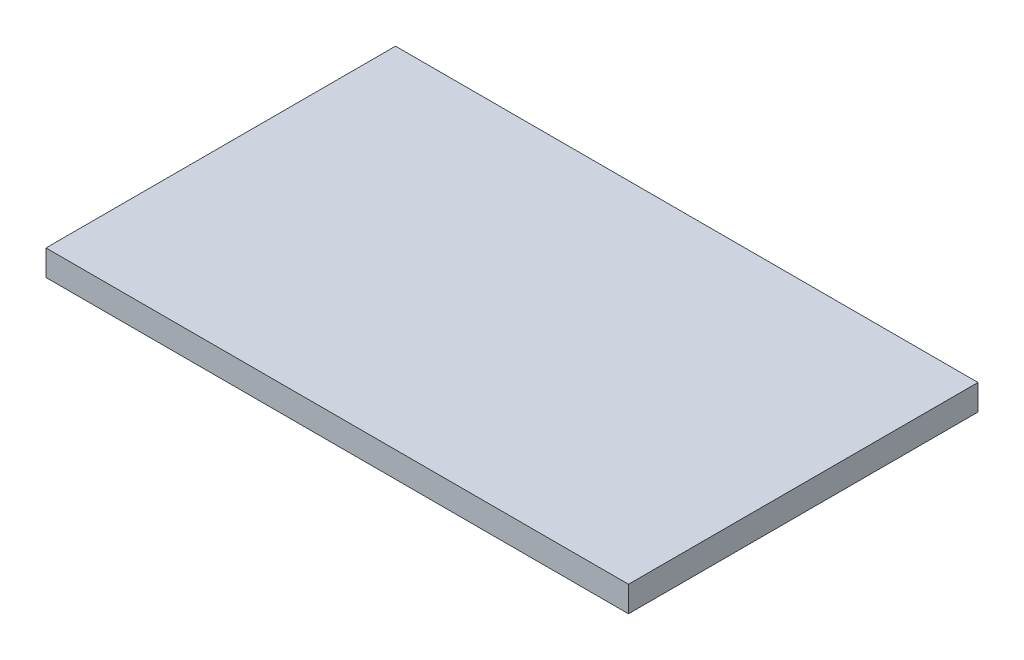
ISO-10303-21;
HEADER;
FILE_DESCRIPTION(('STEP AP214'),'2;1');
FILE_NAME('part.step','',(''),(''),'','','');
FILE_SCHEMA(('AUTOMOTIVE_DESIGN { 1 0 10303 214 1 1 1 1 }'));
ENDSEC;
DATA;
#1=APPLICATION_CONTEXT('core data for automotive mechanical design processes');
#2=APPLICATION_PROTOCOL_DEFINITION('international standard','automotive_design',2000,#1);
#3=PRODUCT_CONTEXT('',#1,'mechanical');
#4=PRODUCT('Part','Part','',(#3));
#5=PRODUCT_RELATED_PRODUCT_CATEGORY('part','',(#4));
#6=PRODUCT_DEFINITION_FORMATION('','',#4);
#7=PRODUCT_DEFINITION_CONTEXT('part definition',#1,'design');
#8=PRODUCT_DEFINITION('design','',#6,#7);
#9=PRODUCT_DEFINITION_SHAPE('','',#8);
#10=(LENGTH_UNIT() NAMED_UNIT(*) SI_UNIT(.MILLI.,.METRE.));
#11=(NAMED_UNIT(*) PLANE_ANGLE_UNIT() SI_UNIT($,.RADIAN.));
#12=(NAMED_UNIT(*) SI_UNIT($,.STERADIAN.) SOLID_ANGLE_UNIT());
#13=UNCERTAINTY_MEASURE_WITH_UNIT(LENGTH_MEASURE(1.E-05),#10,'distance_accuracy_value','');
#14=(GEOMETRIC_REPRESENTATION_CONTEXT(3) GLOBAL_UNCERTAINTY_ASSIGNED_CONTEXT((#13)) GLOBAL_UNIT_ASSIGNED_CONTEXT((#10,
#11,#12)) REPRESENTATION_CONTEXT('',''));
#15=CARTESIAN_POINT('',(0.,0.,0.));
#16=DIRECTION('',(0.,0.,1.));
#17=DIRECTION('',(1.,0.,0.));
#18=AXIS2_PLACEMENT_3D('',#15,#16,#17);
#19=CARTESIAN_POINT('',(0.,5.5,0.));
#20=DIRECTION('',(1.,0.,0.));
#21=DIRECTION('',(0.,0.,-1.));
#22=AXIS2_PLACEMENT_3D('',#19,#20,#21);
#23=PLANE('',#22);
#24=DIRECTION('',(0.,0.,1.));
#25=VECTOR('',#24,1.);
#26=CARTESIAN_POINT('',(0.,0.,0.));
#27=LINE('',#26,#25);
#28=CARTESIAN_POINT('',(0.,0.,-75.));
#29=VERTEX_POINT('',#28);
#30=CARTESIAN_POINT('',(0.,0.,0.));
#31=VERTEX_POINT('',#30);
#32=EDGE_CURVE('E96',#29,#31,#27,.T.);
#33=ORIENTED_EDGE('',*,*,#32,.T.);
#34=DIRECTION('',(0.,-1.,0.));
#35=VECTOR('',#34,1.);
#36=CARTESIAN_POINT('',(0.,5.5,0.));
#37=LINE('',#36,#35);
#38=CARTESIAN_POINT('',(0.,5.5,0.));
#39=VERTEX_POINT('',#38);
#40=EDGE_CURVE('E11',#39,#31,#37,.T.);
#41=ORIENTED_EDGE('',*,*,#40,.F.);
#42=DIRECTION('',(0.,0.,1.));
#43=VECTOR('',#42,1.);
#44=CARTESIAN_POINT('',(0.,5.5,0.));
#45=LINE('',#44,#43);
#46=CARTESIAN_POINT('',(0.,5.5,-75.));
#47=VERTEX_POINT('',#46);
#48=EDGE_CURVE('E84',#47,#39,#45,.T.);
#49=ORIENTED_EDGE('',*,*,#48,.F.);
#50=DIRECTION('',(0.,-1.,0.));
#51=VECTOR('',#50,1.);
#52=CARTESIAN_POINT('',(0.,5.5,-75.));
#53=LINE('',#52,#51);
#54=EDGE_CURVE('E92',#47,#29,#53,.T.);
#55=ORIENTED_EDGE('',*,*,#54,.T.);
#56=EDGE_LOOP('',(#33,#41,#49,#55));
#57=FACE_BOUND('',#56,.T.);
#58=ADVANCED_FACE('F33',(#57),#23,.F.);
#59=CARTESIAN_POINT('',(0.,5.5,0.));
#60=DIRECTION('',(0.,0.,-1.));
#61=DIRECTION('',(-1.,0.,0.));
#62=AXIS2_PLACEMENT_3D('',#59,#60,#61);
#63=PLANE('',#62);
#64=DIRECTION('',(1.,0.,0.));
#65=VECTOR('',#64,1.);
#66=CARTESIAN_POINT('',(0.,0.,0.));
#67=LINE('',#66,#65);
#68=CARTESIAN_POINT('',(125.,0.,0.));
#69=VERTEX_POINT('',#68);
#70=EDGE_CURVE('E88',#31,#69,#67,.T.);
#71=ORIENTED_EDGE('',*,*,#70,.T.);
#72=DIRECTION('',(0.,-1.,0.));
#73=VECTOR('',#72,1.);
#74=CARTESIAN_POINT('',(125.,5.5,0.));
#75=LINE('',#74,#73);
#76=CARTESIAN_POINT('',(125.,5.5,0.));
#77=VERTEX_POINT('',#76);
#78=EDGE_CURVE('E41',#77,#69,#75,.T.);
#79=ORIENTED_EDGE('',*,*,#78,.F.);
#80=DIRECTION('',(1.,0.,0.));
#81=VECTOR('',#80,1.);
#82=CARTESIAN_POINT('',(0.,5.5,0.));
#83=LINE('',#82,#81);
#84=EDGE_CURVE('E79',#39,#77,#83,.T.);
#85=ORIENTED_EDGE('',*,*,#84,.F.);
#86=ORIENTED_EDGE('',*,*,#40,.T.);
#87=EDGE_LOOP('',(#71,#79,#85,#86));
#88=FACE_BOUND('',#87,.T.);
#89=ADVANCED_FACE('F87',(#88),#63,.F.);
#90=CARTESIAN_POINT('',(125.,5.5,0.));
#91=DIRECTION('',(-1.,0.,0.));
#92=DIRECTION('',(0.,0.,1.));
#93=AXIS2_PLACEMENT_3D('',#90,#91,#92);
#94=PLANE('',#93);
#95=DIRECTION('',(0.,0.,-1.));
#96=VECTOR('',#95,1.);
#97=CARTESIAN_POINT('',(125.,0.,0.));
#98=LINE('',#97,#96);
#99=CARTESIAN_POINT('',(125.,0.,-75.));
#100=VERTEX_POINT('',#99);
#101=EDGE_CURVE('E66',#69,#100,#98,.T.);
#102=ORIENTED_EDGE('',*,*,#101,.T.);
#103=DIRECTION('',(0.,-1.,0.));
#104=VECTOR('',#103,1.);
#105=CARTESIAN_POINT('',(125.,5.5,-75.));
#106=LINE('',#105,#104);
#107=CARTESIAN_POINT('',(125.,5.5,-75.));
#108=VERTEX_POINT('',#107);
#109=EDGE_CURVE('E89',#108,#100,#106,.T.);
#110=ORIENTED_EDGE('',*,*,#109,.F.);
#111=DIRECTION('',(0.,0.,-1.));
#112=VECTOR('',#111,1.);
#113=CARTESIAN_POINT('',(125.,5.5,0.));
#114=LINE('',#113,#112);
#115=EDGE_CURVE('E82',#77,#108,#114,.T.);
#116=ORIENTED_EDGE('',*,*,#115,.F.);
#117=ORIENTED_EDGE('',*,*,#78,.T.);
#118=EDGE_LOOP('',(#102,#110,#116,#117));
#119=FACE_BOUND('',#118,.T.);
#120=ADVANCED_FACE('F90',(#119),#94,.F.);
#121=CARTESIAN_POINT('',(0.,5.5,-75.));
#122=DIRECTION('',(0.,0.,1.));
#123=DIRECTION('',(1.,0.,0.));
#124=AXIS2_PLACEMENT_3D('',#121,#122,#123);
#125=PLANE('',#124);
#126=DIRECTION('',(-1.,0.,0.));
#127=VECTOR('',#126,1.);
#128=CARTESIAN_POINT('',(0.,0.,-75.));
#129=LINE('',#128,#127);
#130=EDGE_CURVE('E72',#100,#29,#129,.T.);
#131=ORIENTED_EDGE('',*,*,#130,.T.);
#132=ORIENTED_EDGE('',*,*,#54,.F.);
#133=DIRECTION('',(-1.,0.,0.));
#134=VECTOR('',#133,1.);
#135=CARTESIAN_POINT('',(0.,5.5,-75.));
#136=LINE('',#135,#134);
#137=EDGE_CURVE('E49',#108,#47,#136,.T.);
#138=ORIENTED_EDGE('',*,*,#137,.F.);
#139=ORIENTED_EDGE('',*,*,#109,.T.);
#140=EDGE_LOOP('',(#131,#132,#138,#139));
#141=FACE_BOUND('',#140,.T.);
#142=ADVANCED_FACE('F103',(#141),#125,.F.);
#143=CARTESIAN_POINT('',(0.,5.5,-75.));
#144=DIRECTION('',(0.,-1.,0.));
#145=DIRECTION('',(0.,0.,-1.));
#146=AXIS2_PLACEMENT_3D('',#143,#144,#145);
#147=PLANE('',#146);
#148=ORIENTED_EDGE('',*,*,#48,.T.);
#149=ORIENTED_EDGE('',*,*,#84,.T.);
#150=ORIENTED_EDGE('',*,*,#115,.T.);
#151=ORIENTED_EDGE('',*,*,#137,.T.);
#152=EDGE_LOOP('',(#148,#149,#150,#151));
#153=FACE_BOUND('',#152,.T.);
#154=ADVANCED_FACE('F80',(#153),#147,.F.);
#155=CARTESIAN_POINT('',(0.,0.,-75.));
#156=DIRECTION('',(0.,-1.,0.));
#157=DIRECTION('',(0.,0.,-1.));
#158=AXIS2_PLACEMENT_3D('',#155,#156,#157);
#159=PLANE('',#158);
#160=ORIENTED_EDGE('',*,*,#32,.F.);
#161=ORIENTED_EDGE('',*,*,#130,.F.);
#162=ORIENTED_EDGE('',*,*,#101,.F.);
#163=ORIENTED_EDGE('',*,*,#70,.F.);
#164=EDGE_LOOP('',(#160,#161,#162,#163));
#165=FACE_BOUND('',#164,.T.);
#166=ADVANCED_FACE('F106',(#165),#159,.T.);
#167=CLOSED_SHELL('',(#58,#89,#120,#142,#154,#166));
#168=MANIFOLD_SOLID_BREP('B2',#167);
#169=ADVANCED_BREP_SHAPE_REPRESENTATION('',(#18,#168),#14);
#170=SHAPE_DEFINITION_REPRESENTATION(#9,#169);
ENDSEC;
END-ISO-10303-21;
